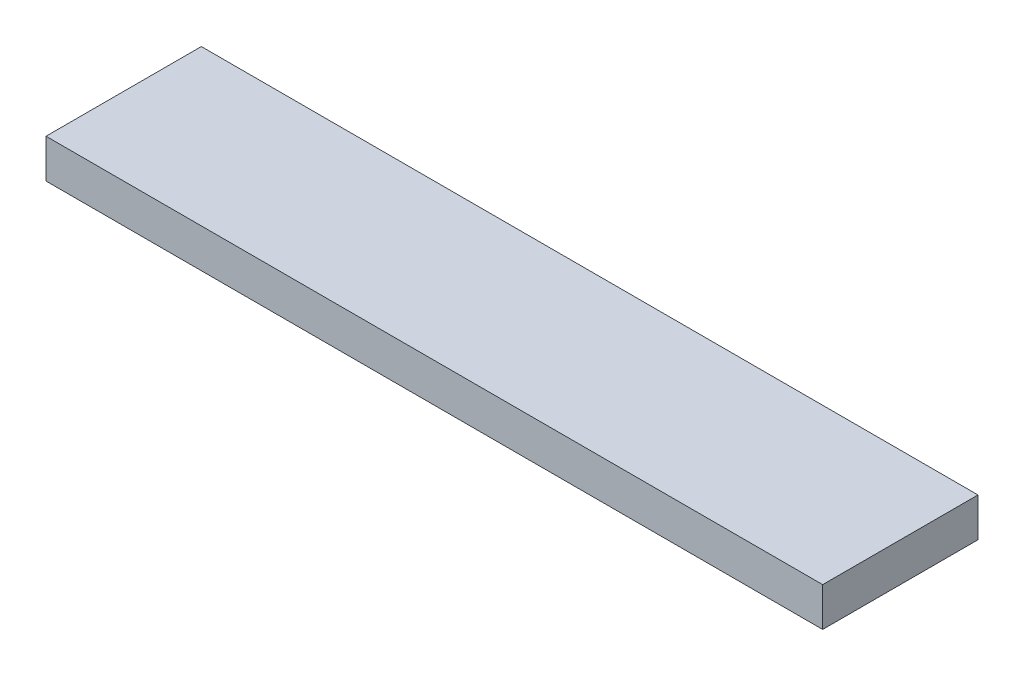
ISO-10303-21;
HEADER;
FILE_DESCRIPTION(('STEP AP214'),'2;1');
FILE_NAME('part.step','',(''),(''),'','','');
FILE_SCHEMA(('AUTOMOTIVE_DESIGN { 1 0 10303 214 1 1 1 1 }'));
ENDSEC;
DATA;
#1=APPLICATION_CONTEXT('core data for automotive mechanical design processes');
#2=APPLICATION_PROTOCOL_DEFINITION('international standard','automotive_design',2000,#1);
#3=PRODUCT_CONTEXT('',#1,'mechanical');
#4=PRODUCT('Part','Part','',(#3));
#5=PRODUCT_RELATED_PRODUCT_CATEGORY('part','',(#4));
#6=PRODUCT_DEFINITION_FORMATION('','',#4);
#7=PRODUCT_DEFINITION_CONTEXT('part definition',#1,'design');
#8=PRODUCT_DEFINITION('design','',#6,#7);
#9=PRODUCT_DEFINITION_SHAPE('','',#8);
#10=(LENGTH_UNIT() NAMED_UNIT(*) SI_UNIT(.MILLI.,.METRE.));
#11=(NAMED_UNIT(*) PLANE_ANGLE_UNIT() SI_UNIT($,.RADIAN.));
#12=(NAMED_UNIT(*) SI_UNIT($,.STERADIAN.) SOLID_ANGLE_UNIT());
#13=UNCERTAINTY_MEASURE_WITH_UNIT(LENGTH_MEASURE(1.E-05),#10,'distance_accuracy_value','');
#14=(GEOMETRIC_REPRESENTATION_CONTEXT(3) GLOBAL_UNCERTAINTY_ASSIGNED_CONTEXT((#13)) GLOBAL_UNIT_ASSIGNED_CONTEXT((#10,
#11,#12)) REPRESENTATION_CONTEXT('',''));
#15=CARTESIAN_POINT('',(0.,0.,0.));
#16=DIRECTION('',(0.,0.,1.));
#17=DIRECTION('',(1.,0.,0.));
#18=AXIS2_PLACEMENT_3D('',#15,#16,#17);
#19=CARTESIAN_POINT('',(-23.2792792792793,20.,-5.68018018018018));
#20=DIRECTION('',(1.,0.,0.));
#21=DIRECTION('',(0.,0.,-1.));
#22=AXIS2_PLACEMENT_3D('',#19,#20,#21);
#23=PLANE('',#22);
#24=DIRECTION('',(0.,0.,1.));
#25=VECTOR('',#24,1.);
#26=CARTESIAN_POINT('',(-23.2792792792793,15.,-5.68018018018018));
#27=LINE('',#26,#25);
#28=CARTESIAN_POINT('',(-23.2792792792793,15.,-5.68018018018018));
#29=VERTEX_POINT('',#28);
#30=CARTESIAN_POINT('',(-23.2792792792793,15.,14.3198198198198));
#31=VERTEX_POINT('',#30);
#32=EDGE_CURVE('E95',#29,#31,#27,.T.);
#33=ORIENTED_EDGE('',*,*,#32,.T.);
#34=DIRECTION('',(0.,-1.,0.));
#35=VECTOR('',#34,1.);
#36=CARTESIAN_POINT('',(-23.2792792792793,20.,14.3198198198198));
#37=LINE('',#36,#35);
#38=CARTESIAN_POINT('',(-23.2792792792793,20.,14.3198198198198));
#39=VERTEX_POINT('',#38);
#40=EDGE_CURVE('E11',#39,#31,#37,.T.);
#41=ORIENTED_EDGE('',*,*,#40,.F.);
#42=DIRECTION('',(0.,0.,1.));
#43=VECTOR('',#42,1.);
#44=CARTESIAN_POINT('',(-23.2792792792793,20.,-5.68018018018018));
#45=LINE('',#44,#43);
#46=CARTESIAN_POINT('',(-23.2792792792793,20.,-5.68018018018018));
#47=VERTEX_POINT('',#46);
#48=EDGE_CURVE('E83',#47,#39,#45,.T.);
#49=ORIENTED_EDGE('',*,*,#48,.F.);
#50=DIRECTION('',(0.,-1.,0.));
#51=VECTOR('',#50,1.);
#52=CARTESIAN_POINT('',(-23.2792792792793,20.,-5.68018018018018));
#53=LINE('',#52,#51);
#54=EDGE_CURVE('E91',#47,#29,#53,.T.);
#55=ORIENTED_EDGE('',*,*,#54,.T.);
#56=EDGE_LOOP('',(#33,#41,#49,#55));
#57=FACE_BOUND('',#56,.T.);
#58=ADVANCED_FACE('F32',(#57),#23,.F.);
#59=CARTESIAN_POINT('',(-23.2792792792793,20.,14.3198198198198));
#60=DIRECTION('',(0.,0.,-1.));
#61=DIRECTION('',(-1.,0.,0.));
#62=AXIS2_PLACEMENT_3D('',#59,#60,#61);
#63=PLANE('',#62);
#64=DIRECTION('',(1.,0.,0.));
#65=VECTOR('',#64,1.);
#66=CARTESIAN_POINT('',(-23.2792792792793,15.,14.3198198198198));
#67=LINE('',#66,#65);
#68=CARTESIAN_POINT('',(76.7207207207207,15.,14.3198198198198));
#69=VERTEX_POINT('',#68);
#70=EDGE_CURVE('E87',#31,#69,#67,.T.);
#71=ORIENTED_EDGE('',*,*,#70,.T.);
#72=DIRECTION('',(0.,-1.,0.));
#73=VECTOR('',#72,1.);
#74=CARTESIAN_POINT('',(76.7207207207207,20.,14.3198198198198));
#75=LINE('',#74,#73);
#76=CARTESIAN_POINT('',(76.7207207207207,20.,14.3198198198198));
#77=VERTEX_POINT('',#76);
#78=EDGE_CURVE('E40',#77,#69,#75,.T.);
#79=ORIENTED_EDGE('',*,*,#78,.F.);
#80=DIRECTION('',(1.,0.,0.));
#81=VECTOR('',#80,1.);
#82=CARTESIAN_POINT('',(-23.2792792792793,20.,14.3198198198198));
#83=LINE('',#82,#81);
#84=EDGE_CURVE('E78',#39,#77,#83,.T.);
#85=ORIENTED_EDGE('',*,*,#84,.F.);
#86=ORIENTED_EDGE('',*,*,#40,.T.);
#87=EDGE_LOOP('',(#71,#79,#85,#86));
#88=FACE_BOUND('',#87,.T.);
#89=ADVANCED_FACE('F86',(#88),#63,.F.);
#90=CARTESIAN_POINT('',(76.7207207207207,20.,-5.68018018018018));
#91=DIRECTION('',(-1.,0.,0.));
#92=DIRECTION('',(0.,0.,1.));
#93=AXIS2_PLACEMENT_3D('',#90,#91,#92);
#94=PLANE('',#93);
#95=DIRECTION('',(0.,0.,-1.));
#96=VECTOR('',#95,1.);
#97=CARTESIAN_POINT('',(76.7207207207207,15.,-5.68018018018018));
#98=LINE('',#97,#96);
#99=CARTESIAN_POINT('',(76.7207207207207,15.,-5.68018018018018));
#100=VERTEX_POINT('',#99);
#101=EDGE_CURVE('E65',#69,#100,#98,.T.);
#102=ORIENTED_EDGE('',*,*,#101,.T.);
#103=DIRECTION('',(0.,-1.,0.));
#104=VECTOR('',#103,1.);
#105=CARTESIAN_POINT('',(76.7207207207207,20.,-5.68018018018018));
#106=LINE('',#105,#104);
#107=CARTESIAN_POINT('',(76.7207207207207,20.,-5.68018018018018));
#108=VERTEX_POINT('',#107);
#109=EDGE_CURVE('E88',#108,#100,#106,.T.);
#110=ORIENTED_EDGE('',*,*,#109,.F.);
#111=DIRECTION('',(0.,0.,-1.));
#112=VECTOR('',#111,1.);
#113=CARTESIAN_POINT('',(76.7207207207207,20.,-5.68018018018018));
#114=LINE('',#113,#112);
#115=EDGE_CURVE('E81',#77,#108,#114,.T.);
#116=ORIENTED_EDGE('',*,*,#115,.F.);
#117=ORIENTED_EDGE('',*,*,#78,.T.);
#118=EDGE_LOOP('',(#102,#110,#116,#117));
#119=FACE_BOUND('',#118,.T.);
#120=ADVANCED_FACE('F89',(#119),#94,.F.);
#121=CARTESIAN_POINT('',(-23.2792792792793,20.,-5.68018018018018));
#122=DIRECTION('',(0.,0.,1.));
#123=DIRECTION('',(1.,0.,0.));
#124=AXIS2_PLACEMENT_3D('',#121,#122,#123);
#125=PLANE('',#124);
#126=DIRECTION('',(-1.,0.,0.));
#127=VECTOR('',#126,1.);
#128=CARTESIAN_POINT('',(-23.2792792792793,15.,-5.68018018018018));
#129=LINE('',#128,#127);
#130=EDGE_CURVE('E71',#100,#29,#129,.T.);
#131=ORIENTED_EDGE('',*,*,#130,.T.);
#132=ORIENTED_EDGE('',*,*,#54,.F.);
#133=DIRECTION('',(-1.,0.,0.));
#134=VECTOR('',#133,1.);
#135=CARTESIAN_POINT('',(-23.2792792792793,20.,-5.68018018018018));
#136=LINE('',#135,#134);
#137=EDGE_CURVE('E48',#108,#47,#136,.T.);
#138=ORIENTED_EDGE('',*,*,#137,.F.);
#139=ORIENTED_EDGE('',*,*,#109,.T.);
#140=EDGE_LOOP('',(#131,#132,#138,#139));
#141=FACE_BOUND('',#140,.T.);
#142=ADVANCED_FACE('F102',(#141),#125,.F.);
#143=CARTESIAN_POINT('',(0.,20.,0.));
#144=DIRECTION('',(0.,1.,0.));
#145=DIRECTION('',(0.,0.,1.));
#146=AXIS2_PLACEMENT_3D('',#143,#144,#145);
#147=PLANE('',#146);
#148=ORIENTED_EDGE('',*,*,#48,.T.);
#149=ORIENTED_EDGE('',*,*,#84,.T.);
#150=ORIENTED_EDGE('',*,*,#115,.T.);
#151=ORIENTED_EDGE('',*,*,#137,.T.);
#152=EDGE_LOOP('',(#148,#149,#150,#151));
#153=FACE_BOUND('',#152,.T.);
#154=ADVANCED_FACE('F79',(#153),#147,.T.);
#155=CARTESIAN_POINT('',(0.,15.,0.));
#156=DIRECTION('',(0.,1.,0.));
#157=DIRECTION('',(0.,0.,1.));
#158=AXIS2_PLACEMENT_3D('',#155,#156,#157);
#159=PLANE('',#158);
#160=ORIENTED_EDGE('',*,*,#32,.F.);
#161=ORIENTED_EDGE('',*,*,#130,.F.);
#162=ORIENTED_EDGE('',*,*,#101,.F.);
#163=ORIENTED_EDGE('',*,*,#70,.F.);
#164=EDGE_LOOP('',(#160,#161,#162,#163));
#165=FACE_BOUND('',#164,.T.);
#166=ADVANCED_FACE('F105',(#165),#159,.F.);
#167=CLOSED_SHELL('',(#58,#89,#120,#142,#154,#166));
#168=MANIFOLD_SOLID_BREP('B2',#167);
#169=ADVANCED_BREP_SHAPE_REPRESENTATION('',(#18,#168),#14);
#170=SHAPE_DEFINITION_REPRESENTATION(#9,#169);
ENDSEC;
END-ISO-10303-21;
